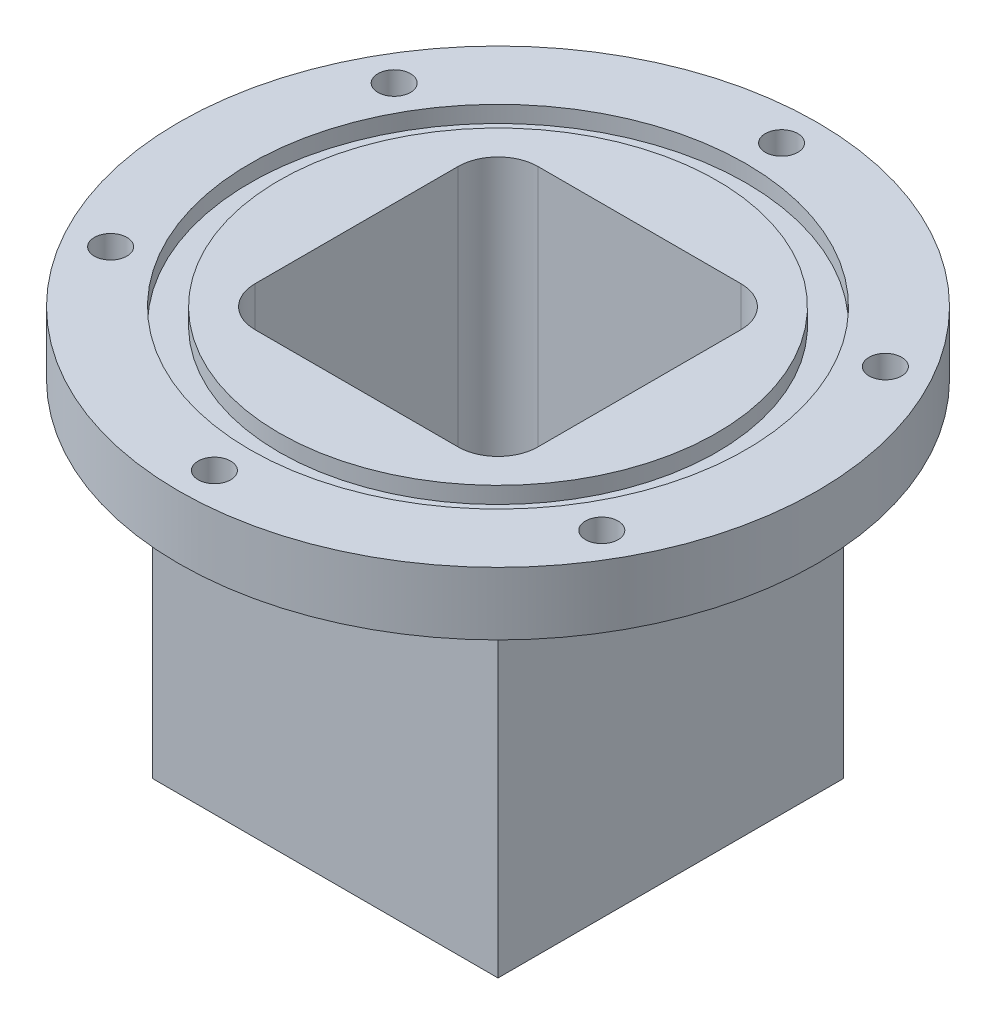
ISO-10303-21;
HEADER;
FILE_DESCRIPTION(('STEP AP214'),'2;1');
FILE_NAME('part.step','',(''),(''),'','','');
FILE_SCHEMA(('AUTOMOTIVE_DESIGN { 1 0 10303 214 1 1 1 1 }'));
ENDSEC;
DATA;
#1=APPLICATION_CONTEXT('core data for automotive mechanical design processes');
#2=APPLICATION_PROTOCOL_DEFINITION('international standard','automotive_design',2000,#1);
#3=PRODUCT_CONTEXT('',#1,'mechanical');
#4=PRODUCT('Part','Part','',(#3));
#5=PRODUCT_RELATED_PRODUCT_CATEGORY('part','',(#4));
#6=PRODUCT_DEFINITION_FORMATION('','',#4);
#7=PRODUCT_DEFINITION_CONTEXT('part definition',#1,'design');
#8=PRODUCT_DEFINITION('design','',#6,#7);
#9=PRODUCT_DEFINITION_SHAPE('','',#8);
#10=(LENGTH_UNIT() NAMED_UNIT(*) SI_UNIT(.MILLI.,.METRE.));
#11=(NAMED_UNIT(*) PLANE_ANGLE_UNIT() SI_UNIT($,.RADIAN.));
#12=(NAMED_UNIT(*) SI_UNIT($,.STERADIAN.) SOLID_ANGLE_UNIT());
#13=UNCERTAINTY_MEASURE_WITH_UNIT(LENGTH_MEASURE(1.E-05),#10,'distance_accuracy_value','');
#14=(GEOMETRIC_REPRESENTATION_CONTEXT(3) GLOBAL_UNCERTAINTY_ASSIGNED_CONTEXT((#13)) GLOBAL_UNIT_ASSIGNED_CONTEXT((#10,
#11,#12)) REPRESENTATION_CONTEXT('',''));
#15=CARTESIAN_POINT('',(0.,0.,0.));
#16=DIRECTION('',(0.,0.,1.));
#17=DIRECTION('',(1.,0.,0.));
#18=AXIS2_PLACEMENT_3D('',#15,#16,#17);
#19=CARTESIAN_POINT('',(0.,60.,0.));
#20=DIRECTION('',(0.,1.,0.));
#21=DIRECTION('',(0.,0.,1.));
#22=AXIS2_PLACEMENT_3D('',#19,#20,#21);
#23=PLANE('',#22);
#24=DIRECTION('',(0.,0.,-1.));
#25=VECTOR('',#24,1.);
#26=CARTESIAN_POINT('',(22.5,60.,0.));
#27=LINE('',#26,#25);
#28=CARTESIAN_POINT('',(22.5,60.,16.15));
#29=VERTEX_POINT('',#28);
#30=CARTESIAN_POINT('',(22.5,60.,-16.15));
#31=VERTEX_POINT('',#30);
#32=EDGE_CURVE('E277',#29,#31,#27,.T.);
#33=ORIENTED_EDGE('',*,*,#32,.F.);
#34=CARTESIAN_POINT('',(16.15,60.,16.15));
#35=DIRECTION('',(0.,1.,0.));
#36=DIRECTION('',(0.,0.,1.));
#37=AXIS2_PLACEMENT_3D('',#34,#35,#36);
#38=CIRCLE('',#37,6.35);
#39=CARTESIAN_POINT('',(16.15,60.,22.5));
#40=VERTEX_POINT('',#39);
#41=EDGE_CURVE('E199',#29,#40,#38,.F.);
#42=ORIENTED_EDGE('',*,*,#41,.T.);
#43=DIRECTION('',(-1.,0.,0.));
#44=VECTOR('',#43,1.);
#45=CARTESIAN_POINT('',(0.,60.,22.5));
#46=LINE('',#45,#44);
#47=CARTESIAN_POINT('',(-16.15,60.,22.5));
#48=VERTEX_POINT('',#47);
#49=EDGE_CURVE('E269',#40,#48,#46,.T.);
#50=ORIENTED_EDGE('',*,*,#49,.T.);
#51=CARTESIAN_POINT('',(-16.15,60.,16.15));
#52=DIRECTION('',(0.,1.,0.));
#53=DIRECTION('',(0.,0.,1.));
#54=AXIS2_PLACEMENT_3D('',#51,#52,#53);
#55=CIRCLE('',#54,6.35);
#56=CARTESIAN_POINT('',(-22.5,60.,16.15));
#57=VERTEX_POINT('',#56);
#58=EDGE_CURVE('E11',#48,#57,#55,.F.);
#59=ORIENTED_EDGE('',*,*,#58,.T.);
#60=DIRECTION('',(0.,0.,-1.));
#61=VECTOR('',#60,1.);
#62=CARTESIAN_POINT('',(-22.5,60.,0.));
#63=LINE('',#62,#61);
#64=CARTESIAN_POINT('',(-22.5,60.,-16.15));
#65=VERTEX_POINT('',#64);
#66=EDGE_CURVE('E271',#57,#65,#63,.T.);
#67=ORIENTED_EDGE('',*,*,#66,.T.);
#68=CARTESIAN_POINT('',(-16.15,60.,-16.15));
#69=DIRECTION('',(0.,1.,0.));
#70=DIRECTION('',(0.,0.,1.));
#71=AXIS2_PLACEMENT_3D('',#68,#69,#70);
#72=CIRCLE('',#71,6.35);
#73=CARTESIAN_POINT('',(-16.15,60.,-22.5));
#74=VERTEX_POINT('',#73);
#75=EDGE_CURVE('E46',#65,#74,#72,.F.);
#76=ORIENTED_EDGE('',*,*,#75,.T.);
#77=DIRECTION('',(-1.,0.,0.));
#78=VECTOR('',#77,1.);
#79=CARTESIAN_POINT('',(0.,60.,-22.5));
#80=LINE('',#79,#78);
#81=CARTESIAN_POINT('',(16.15,60.,-22.5));
#82=VERTEX_POINT('',#81);
#83=EDGE_CURVE('E274',#82,#74,#80,.T.);
#84=ORIENTED_EDGE('',*,*,#83,.F.);
#85=CARTESIAN_POINT('',(16.15,60.,-16.15));
#86=DIRECTION('',(0.,1.,0.));
#87=DIRECTION('',(0.,0.,1.));
#88=AXIS2_PLACEMENT_3D('',#85,#86,#87);
#89=CIRCLE('',#88,6.35);
#90=EDGE_CURVE('E197',#82,#31,#89,.F.);
#91=ORIENTED_EDGE('',*,*,#90,.T.);
#92=EDGE_LOOP('',(#33,#42,#50,#59,#67,#76,#84,#91));
#93=FACE_BOUND('',#92,.T.);
#94=CARTESIAN_POINT('',(0.,60.,0.));
#95=DIRECTION('',(0.,1.,0.));
#96=DIRECTION('',(0.,0.,1.));
#97=AXIS2_PLACEMENT_3D('',#94,#95,#96);
#98=CIRCLE('',#97,34.8198051533946);
#99=CARTESIAN_POINT('',(0.,60.,34.8198051533946));
#100=VERTEX_POINT('',#99);
#101=EDGE_CURVE('E205',#100,#100,#98,.T.);
#102=ORIENTED_EDGE('',*,*,#101,.T.);
#103=EDGE_LOOP('',(#102));
#104=FACE_BOUND('',#103,.T.);
#105=ADVANCED_FACE('F37',(#93,#104),#23,.T.);
#106=CARTESIAN_POINT('',(0.,60.,22.5));
#107=DIRECTION('',(0.,0.,1.));
#108=DIRECTION('',(1.,0.,0.));
#109=AXIS2_PLACEMENT_3D('',#106,#107,#108);
#110=PLANE('',#109);
#111=ORIENTED_EDGE('',*,*,#49,.F.);
#112=DIRECTION('',(0.,-1.,0.));
#113=VECTOR('',#112,1.);
#114=CARTESIAN_POINT('',(16.15,60.,22.5));
#115=LINE('',#114,#113);
#116=CARTESIAN_POINT('',(16.15,0.,22.5));
#117=VERTEX_POINT('',#116);
#118=EDGE_CURVE('E190',#40,#117,#115,.T.);
#119=ORIENTED_EDGE('',*,*,#118,.T.);
#120=DIRECTION('',(-1.,0.,0.));
#121=VECTOR('',#120,1.);
#122=CARTESIAN_POINT('',(0.,0.,22.5));
#123=LINE('',#122,#121);
#124=CARTESIAN_POINT('',(-16.15,0.,22.5));
#125=VERTEX_POINT('',#124);
#126=EDGE_CURVE('E266',#117,#125,#123,.T.);
#127=ORIENTED_EDGE('',*,*,#126,.T.);
#128=DIRECTION('',(0.,-1.,0.));
#129=VECTOR('',#128,1.);
#130=CARTESIAN_POINT('',(-16.15,60.,22.5));
#131=LINE('',#130,#129);
#132=EDGE_CURVE('E188',#125,#48,#131,.F.);
#133=ORIENTED_EDGE('',*,*,#132,.T.);
#134=EDGE_LOOP('',(#111,#119,#127,#133));
#135=FACE_BOUND('',#134,.T.);
#136=ADVANCED_FACE('F314',(#135),#110,.F.);
#137=CARTESIAN_POINT('',(-22.5,60.,0.));
#138=DIRECTION('',(-1.,0.,0.));
#139=DIRECTION('',(0.,0.,1.));
#140=AXIS2_PLACEMENT_3D('',#137,#138,#139);
#141=PLANE('',#140);
#142=DIRECTION('',(0.,0.,-1.));
#143=VECTOR('',#142,1.);
#144=CARTESIAN_POINT('',(-22.5,0.,0.));
#145=LINE('',#144,#143);
#146=CARTESIAN_POINT('',(-22.5,0.,16.15));
#147=VERTEX_POINT('',#146);
#148=CARTESIAN_POINT('',(-22.5,0.,-16.15));
#149=VERTEX_POINT('',#148);
#150=EDGE_CURVE('E283',#147,#149,#145,.T.);
#151=ORIENTED_EDGE('',*,*,#150,.T.);
#152=DIRECTION('',(0.,-1.,0.));
#153=VECTOR('',#152,1.);
#154=CARTESIAN_POINT('',(-22.5,60.,-16.15));
#155=LINE('',#154,#153);
#156=EDGE_CURVE('E54',#149,#65,#155,.F.);
#157=ORIENTED_EDGE('',*,*,#156,.T.);
#158=ORIENTED_EDGE('',*,*,#66,.F.);
#159=DIRECTION('',(0.,-1.,0.));
#160=VECTOR('',#159,1.);
#161=CARTESIAN_POINT('',(-22.5,0.,16.15));
#162=LINE('',#161,#160);
#163=EDGE_CURVE('E193',#57,#147,#162,.T.);
#164=ORIENTED_EDGE('',*,*,#163,.T.);
#165=EDGE_LOOP('',(#151,#157,#158,#164));
#166=FACE_BOUND('',#165,.T.);
#167=ADVANCED_FACE('F320',(#166),#141,.F.);
#168=CARTESIAN_POINT('',(0.,60.,-22.5));
#169=DIRECTION('',(0.,0.,1.));
#170=DIRECTION('',(1.,0.,0.));
#171=AXIS2_PLACEMENT_3D('',#168,#169,#170);
#172=PLANE('',#171);
#173=DIRECTION('',(-1.,0.,0.));
#174=VECTOR('',#173,1.);
#175=CARTESIAN_POINT('',(0.,0.,-22.5));
#176=LINE('',#175,#174);
#177=CARTESIAN_POINT('',(16.15,0.,-22.5));
#178=VERTEX_POINT('',#177);
#179=CARTESIAN_POINT('',(-16.15,0.,-22.5));
#180=VERTEX_POINT('',#179);
#181=EDGE_CURVE('E285',#178,#180,#176,.T.);
#182=ORIENTED_EDGE('',*,*,#181,.F.);
#183=DIRECTION('',(0.,-1.,0.));
#184=VECTOR('',#183,1.);
#185=CARTESIAN_POINT('',(16.15,60.,-22.5));
#186=LINE('',#185,#184);
#187=EDGE_CURVE('E186',#178,#82,#186,.F.);
#188=ORIENTED_EDGE('',*,*,#187,.T.);
#189=ORIENTED_EDGE('',*,*,#83,.T.);
#190=DIRECTION('',(0.,-1.,0.));
#191=VECTOR('',#190,1.);
#192=CARTESIAN_POINT('',(-16.15,60.,-22.5));
#193=LINE('',#192,#191);
#194=EDGE_CURVE('E183',#74,#180,#193,.T.);
#195=ORIENTED_EDGE('',*,*,#194,.T.);
#196=EDGE_LOOP('',(#182,#188,#189,#195));
#197=FACE_BOUND('',#196,.T.);
#198=ADVANCED_FACE('F338',(#197),#172,.T.);
#199=CARTESIAN_POINT('',(22.5,60.,0.));
#200=DIRECTION('',(-1.,0.,0.));
#201=DIRECTION('',(0.,0.,1.));
#202=AXIS2_PLACEMENT_3D('',#199,#200,#201);
#203=PLANE('',#202);
#204=ORIENTED_EDGE('',*,*,#32,.T.);
#205=DIRECTION('',(0.,-1.,0.));
#206=VECTOR('',#205,1.);
#207=CARTESIAN_POINT('',(22.5,0.,-16.15));
#208=LINE('',#207,#206);
#209=CARTESIAN_POINT('',(22.5,0.,-16.15));
#210=VERTEX_POINT('',#209);
#211=EDGE_CURVE('E172',#31,#210,#208,.T.);
#212=ORIENTED_EDGE('',*,*,#211,.T.);
#213=DIRECTION('',(0.,0.,-1.));
#214=VECTOR('',#213,1.);
#215=CARTESIAN_POINT('',(22.5,0.,0.));
#216=LINE('',#215,#214);
#217=CARTESIAN_POINT('',(22.5,0.,16.15));
#218=VERTEX_POINT('',#217);
#219=EDGE_CURVE('E272',#218,#210,#216,.T.);
#220=ORIENTED_EDGE('',*,*,#219,.F.);
#221=DIRECTION('',(0.,-1.,0.));
#222=VECTOR('',#221,1.);
#223=CARTESIAN_POINT('',(22.5,60.,16.15));
#224=LINE('',#223,#222);
#225=EDGE_CURVE('E156',#218,#29,#224,.F.);
#226=ORIENTED_EDGE('',*,*,#225,.T.);
#227=EDGE_LOOP('',(#204,#212,#220,#226));
#228=FACE_BOUND('',#227,.T.);
#229=ADVANCED_FACE('F329',(#228),#203,.T.);
#230=CARTESIAN_POINT('',(-39.0749818476991,60.,-22.5599512883481));
#231=DIRECTION('',(0.,1.,0.));
#232=DIRECTION('',(0.,0.,1.));
#233=AXIS2_PLACEMENT_3D('',#230,#231,#232);
#234=CIRCLE('',#233,2.59079999999998);
#235=CARTESIAN_POINT('',(-39.0749818476991,60.,-19.9691512883482));
#236=VERTEX_POINT('',#235);
#237=EDGE_CURVE('E230',#236,#236,#234,.T.);
#238=ORIENTED_EDGE('',*,*,#237,.F.);
#239=EDGE_LOOP('',(#238));
#240=FACE_BOUND('',#239,.T.);
#241=CARTESIAN_POINT('',(-4.8919202022546E-13,60.,-45.1199025766973));
#242=DIRECTION('',(0.,1.,0.));
#243=DIRECTION('',(0.,0.,1.));
#244=AXIS2_PLACEMENT_3D('',#241,#242,#243);
#245=CIRCLE('',#244,2.59079999999999);
#246=CARTESIAN_POINT('',(-4.8919202022546E-13,60.,-42.5291025766973));
#247=VERTEX_POINT('',#246);
#248=EDGE_CURVE('E220',#247,#247,#245,.T.);
#249=ORIENTED_EDGE('',*,*,#248,.F.);
#250=EDGE_LOOP('',(#249));
#251=FACE_BOUND('',#250,.T.);
#252=CARTESIAN_POINT('',(39.0749818476988,60.,-22.5599512883487));
#253=DIRECTION('',(0.,1.,0.));
#254=DIRECTION('',(0.,0.,1.));
#255=AXIS2_PLACEMENT_3D('',#252,#253,#254);
#256=CIRCLE('',#255,2.59079999999998);
#257=CARTESIAN_POINT('',(39.0749818476988,60.,-19.9691512883487));
#258=VERTEX_POINT('',#257);
#259=EDGE_CURVE('E217',#258,#258,#256,.T.);
#260=ORIENTED_EDGE('',*,*,#259,.F.);
#261=EDGE_LOOP('',(#260));
#262=FACE_BOUND('',#261,.T.);
#263=CARTESIAN_POINT('',(39.074981847699,60.,22.5599512883484));
#264=DIRECTION('',(0.,1.,0.));
#265=DIRECTION('',(0.,0.,1.));
#266=AXIS2_PLACEMENT_3D('',#263,#264,#265);
#267=CIRCLE('',#266,2.59079999999998);
#268=CARTESIAN_POINT('',(39.074981847699,60.,25.1507512883484));
#269=VERTEX_POINT('',#268);
#270=EDGE_CURVE('E214',#269,#269,#267,.T.);
#271=ORIENTED_EDGE('',*,*,#270,.F.);
#272=EDGE_LOOP('',(#271));
#273=FACE_BOUND('',#272,.T.);
#274=CARTESIAN_POINT('',(1.73472347597681E-13,60.,45.1199025766973));
#275=DIRECTION('',(0.,1.,0.));
#276=DIRECTION('',(0.,0.,1.));
#277=AXIS2_PLACEMENT_3D('',#274,#275,#276);
#278=CIRCLE('',#277,2.59079999999999);
#279=CARTESIAN_POINT('',(1.73472347597681E-13,60.,47.7107025766973));
#280=VERTEX_POINT('',#279);
#281=EDGE_CURVE('E210',#280,#280,#278,.T.);
#282=ORIENTED_EDGE('',*,*,#281,.F.);
#283=EDGE_LOOP('',(#282));
#284=FACE_BOUND('',#283,.T.);
#285=CARTESIAN_POINT('',(-39.0749818476988,60.,22.5599512883487));
#286=DIRECTION('',(0.,1.,0.));
#287=DIRECTION('',(0.,0.,1.));
#288=AXIS2_PLACEMENT_3D('',#285,#286,#287);
#289=CIRCLE('',#288,2.59079999999998);
#290=CARTESIAN_POINT('',(-39.0749818476988,60.,25.1507512883487));
#291=VERTEX_POINT('',#290);
#292=EDGE_CURVE('E206',#291,#291,#289,.T.);
#293=ORIENTED_EDGE('',*,*,#292,.F.);
#294=EDGE_LOOP('',(#293));
#295=FACE_BOUND('',#294,.T.);
#296=CARTESIAN_POINT('',(0.,60.,0.));
#297=DIRECTION('',(0.,1.,0.));
#298=DIRECTION('',(0.,0.,1.));
#299=AXIS2_PLACEMENT_3D('',#296,#297,#298);
#300=CIRCLE('',#299,39.4398051533946);
#301=CARTESIAN_POINT('',(0.,60.,39.4398051533946));
#302=VERTEX_POINT('',#301);
#303=EDGE_CURVE('E243',#302,#302,#300,.T.);
#304=ORIENTED_EDGE('',*,*,#303,.F.);
#305=EDGE_LOOP('',(#304));
#306=FACE_BOUND('',#305,.T.);
#307=CARTESIAN_POINT('',(0.,60.,0.));
#308=DIRECTION('',(0.,1.,0.));
#309=DIRECTION('',(0.,0.,1.));
#310=AXIS2_PLACEMENT_3D('',#307,#308,#309);
#311=CIRCLE('',#310,50.8);
#312=CARTESIAN_POINT('',(0.,60.,50.8));
#313=VERTEX_POINT('',#312);
#314=EDGE_CURVE('E147',#313,#313,#311,.T.);
#315=ORIENTED_EDGE('',*,*,#314,.T.);
#316=EDGE_LOOP('',(#315));
#317=FACE_BOUND('',#316,.T.);
#318=ADVANCED_FACE('F316',(#240,#251,#262,#273,#284,#295,#306,#317),#23,.T.);
#319=CARTESIAN_POINT('',(0.,0.,0.));
#320=DIRECTION('',(0.,1.,0.));
#321=DIRECTION('',(0.,0.,1.));
#322=AXIS2_PLACEMENT_3D('',#319,#320,#321);
#323=PLANE('',#322);
#324=CARTESIAN_POINT('',(0.,0.,0.));
#325=DIRECTION('',(0.,1.,0.));
#326=DIRECTION('',(0.,0.,1.));
#327=AXIS2_PLACEMENT_3D('',#324,#325,#326);
#328=CIRCLE('',#327,2.5908);
#329=CARTESIAN_POINT('',(0.,0.,2.5908));
#330=VERTEX_POINT('',#329);
#331=EDGE_CURVE('E169',#330,#330,#328,.F.);
#332=ORIENTED_EDGE('',*,*,#331,.T.);
#333=EDGE_LOOP('',(#332));
#334=FACE_BOUND('',#333,.T.);
#335=ORIENTED_EDGE('',*,*,#219,.T.);
#336=CARTESIAN_POINT('',(16.15,0.,-16.15));
#337=DIRECTION('',(0.,1.,0.));
#338=DIRECTION('',(0.,0.,1.));
#339=AXIS2_PLACEMENT_3D('',#336,#337,#338);
#340=CIRCLE('',#339,6.35);
#341=EDGE_CURVE('E181',#210,#178,#340,.T.);
#342=ORIENTED_EDGE('',*,*,#341,.T.);
#343=ORIENTED_EDGE('',*,*,#181,.T.);
#344=CARTESIAN_POINT('',(-16.15,0.,-16.15));
#345=DIRECTION('',(0.,1.,0.));
#346=DIRECTION('',(0.,0.,1.));
#347=AXIS2_PLACEMENT_3D('',#344,#345,#346);
#348=CIRCLE('',#347,6.35);
#349=EDGE_CURVE('E177',#180,#149,#348,.T.);
#350=ORIENTED_EDGE('',*,*,#349,.T.);
#351=ORIENTED_EDGE('',*,*,#150,.F.);
#352=CARTESIAN_POINT('',(-16.15,0.,16.15));
#353=DIRECTION('',(0.,1.,0.));
#354=DIRECTION('',(0.,0.,1.));
#355=AXIS2_PLACEMENT_3D('',#352,#353,#354);
#356=CIRCLE('',#355,6.35);
#357=EDGE_CURVE('E175',#147,#125,#356,.T.);
#358=ORIENTED_EDGE('',*,*,#357,.T.);
#359=ORIENTED_EDGE('',*,*,#126,.F.);
#360=CARTESIAN_POINT('',(16.15,0.,16.15));
#361=DIRECTION('',(0.,1.,0.));
#362=DIRECTION('',(0.,0.,1.));
#363=AXIS2_PLACEMENT_3D('',#360,#361,#362);
#364=CIRCLE('',#363,6.35);
#365=EDGE_CURVE('E179',#117,#218,#364,.T.);
#366=ORIENTED_EDGE('',*,*,#365,.T.);
#367=EDGE_LOOP('',(#335,#342,#343,#350,#351,#358,#359,#366));
#368=FACE_BOUND('',#367,.T.);
#369=ADVANCED_FACE('F328',(#334,#368),#323,.T.);
#370=CARTESIAN_POINT('',(0.,50.,0.));
#371=DIRECTION('',(0.,1.,0.));
#372=DIRECTION('',(0.,0.,1.));
#373=AXIS2_PLACEMENT_3D('',#370,#371,#372);
#374=CYLINDRICAL_SURFACE('',#373,50.8);
#375=CARTESIAN_POINT('',(0.,50.,0.));
#376=DIRECTION('',(0.,1.,0.));
#377=DIRECTION('',(0.,0.,1.));
#378=AXIS2_PLACEMENT_3D('',#375,#376,#377);
#379=CIRCLE('',#378,50.8);
#380=CARTESIAN_POINT('',(0.,50.,50.8));
#381=VERTEX_POINT('',#380);
#382=EDGE_CURVE('E263',#381,#381,#379,.T.);
#383=ORIENTED_EDGE('',*,*,#382,.T.);
#384=EDGE_LOOP('',(#383));
#385=FACE_BOUND('',#384,.T.);
#386=ORIENTED_EDGE('',*,*,#314,.F.);
#387=EDGE_LOOP('',(#386));
#388=FACE_BOUND('',#387,.T.);
#389=ADVANCED_FACE('F335',(#385,#388),#374,.T.);
#390=CARTESIAN_POINT('',(0.,50.,0.));
#391=DIRECTION('',(0.,1.,0.));
#392=DIRECTION('',(0.,0.,1.));
#393=AXIS2_PLACEMENT_3D('',#390,#391,#392);
#394=PLANE('',#393);
#395=CARTESIAN_POINT('',(-39.0749818476991,50.,-22.5599512883481));
#396=DIRECTION('',(0.,1.,0.));
#397=DIRECTION('',(0.,0.,1.));
#398=AXIS2_PLACEMENT_3D('',#395,#396,#397);
#399=CIRCLE('',#398,2.59079999999998);
#400=CARTESIAN_POINT('',(-39.0749818476991,50.,-19.9691512883482));
#401=VERTEX_POINT('',#400);
#402=EDGE_CURVE('E41',#401,#401,#399,.T.);
#403=ORIENTED_EDGE('',*,*,#402,.T.);
#404=EDGE_LOOP('',(#403));
#405=FACE_BOUND('',#404,.T.);
#406=CARTESIAN_POINT('',(-4.8919202022546E-13,50.,-45.1199025766973));
#407=DIRECTION('',(0.,1.,0.));
#408=DIRECTION('',(0.,0.,1.));
#409=AXIS2_PLACEMENT_3D('',#406,#407,#408);
#410=CIRCLE('',#409,2.59079999999998);
#411=CARTESIAN_POINT('',(-4.8919202022546E-13,50.,-42.5291025766973));
#412=VERTEX_POINT('',#411);
#413=EDGE_CURVE('E218',#412,#412,#410,.T.);
#414=ORIENTED_EDGE('',*,*,#413,.T.);
#415=EDGE_LOOP('',(#414));
#416=FACE_BOUND('',#415,.T.);
#417=CARTESIAN_POINT('',(39.0749818476988,50.,-22.5599512883487));
#418=DIRECTION('',(0.,1.,0.));
#419=DIRECTION('',(0.,0.,1.));
#420=AXIS2_PLACEMENT_3D('',#417,#418,#419);
#421=CIRCLE('',#420,2.59079999999998);
#422=CARTESIAN_POINT('',(39.0749818476988,50.,-19.9691512883487));
#423=VERTEX_POINT('',#422);
#424=EDGE_CURVE('E215',#423,#423,#421,.T.);
#425=ORIENTED_EDGE('',*,*,#424,.T.);
#426=EDGE_LOOP('',(#425));
#427=FACE_BOUND('',#426,.T.);
#428=CARTESIAN_POINT('',(39.074981847699,50.,22.5599512883484));
#429=DIRECTION('',(0.,1.,0.));
#430=DIRECTION('',(0.,0.,1.));
#431=AXIS2_PLACEMENT_3D('',#428,#429,#430);
#432=CIRCLE('',#431,2.59079999999998);
#433=CARTESIAN_POINT('',(39.074981847699,50.,25.1507512883484));
#434=VERTEX_POINT('',#433);
#435=EDGE_CURVE('E211',#434,#434,#432,.T.);
#436=ORIENTED_EDGE('',*,*,#435,.T.);
#437=EDGE_LOOP('',(#436));
#438=FACE_BOUND('',#437,.T.);
#439=CARTESIAN_POINT('',(1.73472347597681E-13,50.,45.1199025766973));
#440=DIRECTION('',(0.,1.,0.));
#441=DIRECTION('',(0.,0.,1.));
#442=AXIS2_PLACEMENT_3D('',#439,#440,#441);
#443=CIRCLE('',#442,2.59079999999998);
#444=CARTESIAN_POINT('',(1.73472347597681E-13,50.,47.7107025766973));
#445=VERTEX_POINT('',#444);
#446=EDGE_CURVE('E207',#445,#445,#443,.T.);
#447=ORIENTED_EDGE('',*,*,#446,.T.);
#448=EDGE_LOOP('',(#447));
#449=FACE_BOUND('',#448,.T.);
#450=CARTESIAN_POINT('',(-39.0749818476988,50.,22.5599512883487));
#451=DIRECTION('',(0.,1.,0.));
#452=DIRECTION('',(0.,0.,1.));
#453=AXIS2_PLACEMENT_3D('',#450,#451,#452);
#454=CIRCLE('',#453,2.59079999999998);
#455=CARTESIAN_POINT('',(-39.0749818476988,50.,25.1507512883487));
#456=VERTEX_POINT('',#455);
#457=EDGE_CURVE('E202',#456,#456,#454,.T.);
#458=ORIENTED_EDGE('',*,*,#457,.T.);
#459=EDGE_LOOP('',(#458));
#460=FACE_BOUND('',#459,.T.);
#461=DIRECTION('',(1.,0.,0.));
#462=VECTOR('',#461,1.);
#463=CARTESIAN_POINT('',(0.,50.,27.5));
#464=LINE('',#463,#462);
#465=CARTESIAN_POINT('',(-27.5,50.,27.5));
#466=VERTEX_POINT('',#465);
#467=CARTESIAN_POINT('',(27.5,50.,27.5));
#468=VERTEX_POINT('',#467);
#469=EDGE_CURVE('E131',#466,#468,#464,.T.);
#470=ORIENTED_EDGE('',*,*,#469,.T.);
#471=DIRECTION('',(0.,0.,-1.));
#472=VECTOR('',#471,1.);
#473=CARTESIAN_POINT('',(27.5,50.,0.));
#474=LINE('',#473,#472);
#475=CARTESIAN_POINT('',(27.5,50.,-27.5));
#476=VERTEX_POINT('',#475);
#477=EDGE_CURVE('E261',#468,#476,#474,.T.);
#478=ORIENTED_EDGE('',*,*,#477,.T.);
#479=DIRECTION('',(-1.,0.,0.));
#480=VECTOR('',#479,1.);
#481=CARTESIAN_POINT('',(0.,50.,-27.5));
#482=LINE('',#481,#480);
#483=CARTESIAN_POINT('',(-27.5,50.,-27.5));
#484=VERTEX_POINT('',#483);
#485=EDGE_CURVE('E134',#476,#484,#482,.T.);
#486=ORIENTED_EDGE('',*,*,#485,.T.);
#487=DIRECTION('',(0.,0.,1.));
#488=VECTOR('',#487,1.);
#489=CARTESIAN_POINT('',(-27.5,50.,0.));
#490=LINE('',#489,#488);
#491=EDGE_CURVE('E127',#484,#466,#490,.T.);
#492=ORIENTED_EDGE('',*,*,#491,.T.);
#493=EDGE_LOOP('',(#470,#478,#486,#492));
#494=FACE_BOUND('',#493,.T.);
#495=ORIENTED_EDGE('',*,*,#382,.F.);
#496=EDGE_LOOP('',(#495));
#497=FACE_BOUND('',#496,.T.);
#498=ADVANCED_FACE('F129',(#405,#416,#427,#438,#449,#460,#494,#497),#394,.F.);
#499=CARTESIAN_POINT('',(0.,-5.,0.));
#500=DIRECTION('',(0.,1.,0.));
#501=DIRECTION('',(0.,0.,1.));
#502=AXIS2_PLACEMENT_3D('',#499,#500,#501);
#503=PLANE('',#502);
#504=CARTESIAN_POINT('',(0.,-5.,0.));
#505=DIRECTION('',(0.,1.,0.));
#506=DIRECTION('',(0.,0.,1.));
#507=AXIS2_PLACEMENT_3D('',#504,#505,#506);
#508=CIRCLE('',#507,12.);
#509=CARTESIAN_POINT('',(0.,-5.,12.));
#510=VERTEX_POINT('',#509);
#511=EDGE_CURVE('E152',#510,#510,#508,.F.);
#512=ORIENTED_EDGE('',*,*,#511,.F.);
#513=EDGE_LOOP('',(#512));
#514=FACE_BOUND('',#513,.T.);
#515=DIRECTION('',(-1.,0.,0.));
#516=VECTOR('',#515,1.);
#517=CARTESIAN_POINT('',(0.,-5.,27.5));
#518=LINE('',#517,#516);
#519=CARTESIAN_POINT('',(27.5,-5.,27.5));
#520=VERTEX_POINT('',#519);
#521=CARTESIAN_POINT('',(-27.5,-5.,27.5));
#522=VERTEX_POINT('',#521);
#523=EDGE_CURVE('E280',#520,#522,#518,.T.);
#524=ORIENTED_EDGE('',*,*,#523,.T.);
#525=DIRECTION('',(0.,0.,-1.));
#526=VECTOR('',#525,1.);
#527=CARTESIAN_POINT('',(-27.5,-5.,0.));
#528=LINE('',#527,#526);
#529=CARTESIAN_POINT('',(-27.5,-5.,-27.5));
#530=VERTEX_POINT('',#529);
#531=EDGE_CURVE('E150',#522,#530,#528,.T.);
#532=ORIENTED_EDGE('',*,*,#531,.T.);
#533=DIRECTION('',(-1.,0.,0.));
#534=VECTOR('',#533,1.);
#535=CARTESIAN_POINT('',(0.,-5.,-27.5));
#536=LINE('',#535,#534);
#537=CARTESIAN_POINT('',(27.5,-5.,-27.5));
#538=VERTEX_POINT('',#537);
#539=EDGE_CURVE('E293',#538,#530,#536,.T.);
#540=ORIENTED_EDGE('',*,*,#539,.F.);
#541=DIRECTION('',(0.,0.,-1.));
#542=VECTOR('',#541,1.);
#543=CARTESIAN_POINT('',(27.5,-5.,0.));
#544=LINE('',#543,#542);
#545=EDGE_CURVE('E291',#520,#538,#544,.T.);
#546=ORIENTED_EDGE('',*,*,#545,.F.);
#547=EDGE_LOOP('',(#524,#532,#540,#546));
#548=FACE_BOUND('',#547,.T.);
#549=ADVANCED_FACE('F298',(#514,#548),#503,.F.);
#550=CARTESIAN_POINT('',(27.5,-5.,0.));
#551=DIRECTION('',(1.,0.,0.));
#552=DIRECTION('',(0.,0.,-1.));
#553=AXIS2_PLACEMENT_3D('',#550,#551,#552);
#554=PLANE('',#553);
#555=DIRECTION('',(0.,1.,0.));
#556=VECTOR('',#555,1.);
#557=CARTESIAN_POINT('',(27.5,-5.,-27.5));
#558=LINE('',#557,#556);
#559=EDGE_CURVE('E158',#538,#476,#558,.T.);
#560=ORIENTED_EDGE('',*,*,#559,.T.);
#561=ORIENTED_EDGE('',*,*,#477,.F.);
#562=DIRECTION('',(0.,1.,0.));
#563=VECTOR('',#562,1.);
#564=CARTESIAN_POINT('',(27.5,-5.,27.5));
#565=LINE('',#564,#563);
#566=EDGE_CURVE('E146',#520,#468,#565,.T.);
#567=ORIENTED_EDGE('',*,*,#566,.F.);
#568=ORIENTED_EDGE('',*,*,#545,.T.);
#569=EDGE_LOOP('',(#560,#561,#567,#568));
#570=FACE_BOUND('',#569,.T.);
#571=ADVANCED_FACE('F302',(#570),#554,.T.);
#572=CARTESIAN_POINT('',(0.,-5.,-27.5));
#573=DIRECTION('',(0.,0.,-1.));
#574=DIRECTION('',(-1.,0.,0.));
#575=AXIS2_PLACEMENT_3D('',#572,#573,#574);
#576=PLANE('',#575);
#577=DIRECTION('',(0.,1.,0.));
#578=VECTOR('',#577,1.);
#579=CARTESIAN_POINT('',(-27.5,-5.,-27.5));
#580=LINE('',#579,#578);
#581=EDGE_CURVE('E153',#530,#484,#580,.T.);
#582=ORIENTED_EDGE('',*,*,#581,.T.);
#583=ORIENTED_EDGE('',*,*,#485,.F.);
#584=ORIENTED_EDGE('',*,*,#559,.F.);
#585=ORIENTED_EDGE('',*,*,#539,.T.);
#586=EDGE_LOOP('',(#582,#583,#584,#585));
#587=FACE_BOUND('',#586,.T.);
#588=ADVANCED_FACE('F300',(#587),#576,.T.);
#589=CARTESIAN_POINT('',(-27.5,-5.,0.));
#590=DIRECTION('',(1.,0.,0.));
#591=DIRECTION('',(0.,0.,-1.));
#592=AXIS2_PLACEMENT_3D('',#589,#590,#591);
#593=PLANE('',#592);
#594=ORIENTED_EDGE('',*,*,#491,.F.);
#595=ORIENTED_EDGE('',*,*,#581,.F.);
#596=ORIENTED_EDGE('',*,*,#531,.F.);
#597=DIRECTION('',(0.,1.,0.));
#598=VECTOR('',#597,1.);
#599=CARTESIAN_POINT('',(-27.5,-5.,27.5));
#600=LINE('',#599,#598);
#601=EDGE_CURVE('E145',#522,#466,#600,.T.);
#602=ORIENTED_EDGE('',*,*,#601,.T.);
#603=EDGE_LOOP('',(#594,#595,#596,#602));
#604=FACE_BOUND('',#603,.T.);
#605=ADVANCED_FACE('F149',(#604),#593,.F.);
#606=CARTESIAN_POINT('',(0.,-5.,27.5));
#607=DIRECTION('',(0.,0.,-1.));
#608=DIRECTION('',(-1.,0.,0.));
#609=AXIS2_PLACEMENT_3D('',#606,#607,#608);
#610=PLANE('',#609);
#611=ORIENTED_EDGE('',*,*,#469,.F.);
#612=ORIENTED_EDGE('',*,*,#601,.F.);
#613=ORIENTED_EDGE('',*,*,#523,.F.);
#614=ORIENTED_EDGE('',*,*,#566,.T.);
#615=EDGE_LOOP('',(#611,#612,#613,#614));
#616=FACE_BOUND('',#615,.T.);
#617=ADVANCED_FACE('F143',(#616),#610,.F.);
#618=CARTESIAN_POINT('',(0.,-15.,0.));
#619=DIRECTION('',(0.,1.,0.));
#620=DIRECTION('',(0.,0.,1.));
#621=AXIS2_PLACEMENT_3D('',#618,#619,#620);
#622=CYLINDRICAL_SURFACE('',#621,12.);
#623=CARTESIAN_POINT('',(0.,-15.,0.));
#624=DIRECTION('',(0.,-1.,0.));
#625=DIRECTION('',(0.,0.,-1.));
#626=AXIS2_PLACEMENT_3D('',#623,#624,#625);
#627=CIRCLE('',#626,12.);
#628=CARTESIAN_POINT('',(0.,-15.,-12.));
#629=VERTEX_POINT('',#628);
#630=EDGE_CURVE('E257',#629,#629,#627,.T.);
#631=ORIENTED_EDGE('',*,*,#630,.F.);
#632=EDGE_LOOP('',(#631));
#633=FACE_BOUND('',#632,.T.);
#634=ORIENTED_EDGE('',*,*,#511,.T.);
#635=EDGE_LOOP('',(#634));
#636=FACE_BOUND('',#635,.T.);
#637=ADVANCED_FACE('F364',(#633,#636),#622,.T.);
#638=CARTESIAN_POINT('',(0.,-15.,0.));
#639=DIRECTION('',(0.,-1.,0.));
#640=DIRECTION('',(0.,0.,-1.));
#641=AXIS2_PLACEMENT_3D('',#638,#639,#640);
#642=PLANE('',#641);
#643=CARTESIAN_POINT('',(0.,-15.,0.));
#644=DIRECTION('',(0.,-1.,0.));
#645=DIRECTION('',(0.,0.,-1.));
#646=AXIS2_PLACEMENT_3D('',#643,#644,#645);
#647=CIRCLE('',#646,7.);
#648=CARTESIAN_POINT('',(0.,-15.,-7.));
#649=VERTEX_POINT('',#648);
#650=EDGE_CURVE('E246',#649,#649,#647,.T.);
#651=ORIENTED_EDGE('',*,*,#650,.F.);
#652=EDGE_LOOP('',(#651));
#653=FACE_BOUND('',#652,.T.);
#654=ORIENTED_EDGE('',*,*,#630,.T.);
#655=EDGE_LOOP('',(#654));
#656=FACE_BOUND('',#655,.T.);
#657=ADVANCED_FACE('F367',(#653,#656),#642,.T.);
#658=CARTESIAN_POINT('',(0.,-15.,0.));
#659=DIRECTION('',(0.,-1.,0.));
#660=DIRECTION('',(0.,0.,-1.));
#661=AXIS2_PLACEMENT_3D('',#658,#659,#660);
#662=CYLINDRICAL_SURFACE('',#661,2.5908);
#663=CARTESIAN_POINT('',(0.,-5.,0.));
#664=DIRECTION('',(0.,1.,0.));
#665=DIRECTION('',(0.,0.,1.));
#666=AXIS2_PLACEMENT_3D('',#663,#664,#665);
#667=CIRCLE('',#666,2.5908);
#668=CARTESIAN_POINT('',(0.,-5.,2.5908));
#669=VERTEX_POINT('',#668);
#670=EDGE_CURVE('E166',#669,#669,#667,.F.);
#671=ORIENTED_EDGE('',*,*,#670,.T.);
#672=EDGE_LOOP('',(#671));
#673=FACE_BOUND('',#672,.T.);
#674=ORIENTED_EDGE('',*,*,#331,.F.);
#675=EDGE_LOOP('',(#674));
#676=FACE_BOUND('',#675,.T.);
#677=ADVANCED_FACE('F371',(#673,#676),#662,.F.);
#678=CARTESIAN_POINT('',(0.,-5.,0.));
#679=DIRECTION('',(0.,1.,0.));
#680=DIRECTION('',(0.,0.,1.));
#681=AXIS2_PLACEMENT_3D('',#678,#679,#680);
#682=PLANE('',#681);
#683=CARTESIAN_POINT('',(0.,-5.,0.));
#684=DIRECTION('',(0.,1.,0.));
#685=DIRECTION('',(0.,0.,1.));
#686=AXIS2_PLACEMENT_3D('',#683,#684,#685);
#687=CIRCLE('',#686,7.);
#688=CARTESIAN_POINT('',(0.,-5.,7.));
#689=VERTEX_POINT('',#688);
#690=EDGE_CURVE('E170',#689,#689,#687,.F.);
#691=ORIENTED_EDGE('',*,*,#690,.T.);
#692=EDGE_LOOP('',(#691));
#693=FACE_BOUND('',#692,.T.);
#694=ORIENTED_EDGE('',*,*,#670,.F.);
#695=EDGE_LOOP('',(#694));
#696=FACE_BOUND('',#695,.T.);
#697=ADVANCED_FACE('F375',(#693,#696),#682,.F.);
#698=CARTESIAN_POINT('',(0.,14.7989898732233,0.));
#699=DIRECTION('',(0.,-1.,0.));
#700=DIRECTION('',(0.,0.,-1.));
#701=AXIS2_PLACEMENT_3D('',#698,#699,#700);
#702=CYLINDRICAL_SURFACE('',#701,7.);
#703=ORIENTED_EDGE('',*,*,#650,.T.);
#704=EDGE_LOOP('',(#703));
#705=FACE_BOUND('',#704,.T.);
#706=ORIENTED_EDGE('',*,*,#690,.F.);
#707=EDGE_LOOP('',(#706));
#708=FACE_BOUND('',#707,.T.);
#709=ADVANCED_FACE('F379',(#705,#708),#702,.F.);
#710=CARTESIAN_POINT('',(0.,57.36,0.));
#711=DIRECTION('',(0.,1.,0.));
#712=DIRECTION('',(0.,0.,1.));
#713=AXIS2_PLACEMENT_3D('',#710,#711,#712);
#714=CYLINDRICAL_SURFACE('',#713,34.8198051533946);
#715=CARTESIAN_POINT('',(0.,57.36,0.));
#716=DIRECTION('',(0.,1.,0.));
#717=DIRECTION('',(0.,0.,1.));
#718=AXIS2_PLACEMENT_3D('',#715,#716,#717);
#719=CIRCLE('',#718,34.8198051533946);
#720=CARTESIAN_POINT('',(0.,57.36,34.8198051533946));
#721=VERTEX_POINT('',#720);
#722=EDGE_CURVE('E239',#721,#721,#719,.T.);
#723=ORIENTED_EDGE('',*,*,#722,.T.);
#724=EDGE_LOOP('',(#723));
#725=FACE_BOUND('',#724,.T.);
#726=ORIENTED_EDGE('',*,*,#101,.F.);
#727=EDGE_LOOP('',(#726));
#728=FACE_BOUND('',#727,.T.);
#729=ADVANCED_FACE('F383',(#725,#728),#714,.T.);
#730=CARTESIAN_POINT('',(0.,57.36,0.));
#731=DIRECTION('',(0.,1.,0.));
#732=DIRECTION('',(0.,0.,1.));
#733=AXIS2_PLACEMENT_3D('',#730,#731,#732);
#734=CYLINDRICAL_SURFACE('',#733,39.4398051533946);
#735=CARTESIAN_POINT('',(0.,57.36,0.));
#736=DIRECTION('',(0.,1.,0.));
#737=DIRECTION('',(0.,0.,1.));
#738=AXIS2_PLACEMENT_3D('',#735,#736,#737);
#739=CIRCLE('',#738,39.4398051533946);
#740=CARTESIAN_POINT('',(0.,57.36,39.4398051533946));
#741=VERTEX_POINT('',#740);
#742=EDGE_CURVE('E242',#741,#741,#739,.T.);
#743=ORIENTED_EDGE('',*,*,#742,.F.);
#744=EDGE_LOOP('',(#743));
#745=FACE_BOUND('',#744,.T.);
#746=ORIENTED_EDGE('',*,*,#303,.T.);
#747=EDGE_LOOP('',(#746));
#748=FACE_BOUND('',#747,.T.);
#749=ADVANCED_FACE('F387',(#745,#748),#734,.F.);
#750=CARTESIAN_POINT('',(0.,57.36,0.));
#751=DIRECTION('',(0.,1.,0.));
#752=DIRECTION('',(0.,0.,1.));
#753=AXIS2_PLACEMENT_3D('',#750,#751,#752);
#754=PLANE('',#753);
#755=ORIENTED_EDGE('',*,*,#722,.F.);
#756=EDGE_LOOP('',(#755));
#757=FACE_BOUND('',#756,.T.);
#758=ORIENTED_EDGE('',*,*,#742,.T.);
#759=EDGE_LOOP('',(#758));
#760=FACE_BOUND('',#759,.T.);
#761=ADVANCED_FACE('F391',(#757,#760),#754,.T.);
#762=CARTESIAN_POINT('',(16.15,60.,-16.15));
#763=DIRECTION('',(0.,1.,0.));
#764=DIRECTION('',(0.,0.,1.));
#765=AXIS2_PLACEMENT_3D('',#762,#763,#764);
#766=CYLINDRICAL_SURFACE('',#765,6.35);
#767=ORIENTED_EDGE('',*,*,#90,.F.);
#768=ORIENTED_EDGE('',*,*,#187,.F.);
#769=ORIENTED_EDGE('',*,*,#341,.F.);
#770=ORIENTED_EDGE('',*,*,#211,.F.);
#771=EDGE_LOOP('',(#767,#768,#769,#770));
#772=FACE_BOUND('',#771,.T.);
#773=ADVANCED_FACE('F395',(#772),#766,.F.);
#774=CARTESIAN_POINT('',(16.15,60.,16.15));
#775=DIRECTION('',(0.,-1.,0.));
#776=DIRECTION('',(0.,0.,-1.));
#777=AXIS2_PLACEMENT_3D('',#774,#775,#776);
#778=CYLINDRICAL_SURFACE('',#777,6.35);
#779=ORIENTED_EDGE('',*,*,#41,.F.);
#780=ORIENTED_EDGE('',*,*,#225,.F.);
#781=ORIENTED_EDGE('',*,*,#365,.F.);
#782=ORIENTED_EDGE('',*,*,#118,.F.);
#783=EDGE_LOOP('',(#779,#780,#781,#782));
#784=FACE_BOUND('',#783,.T.);
#785=ADVANCED_FACE('F469',(#784),#778,.F.);
#786=CARTESIAN_POINT('',(-16.15,60.,-16.15));
#787=DIRECTION('',(0.,-1.,0.));
#788=DIRECTION('',(0.,0.,-1.));
#789=AXIS2_PLACEMENT_3D('',#786,#787,#788);
#790=CYLINDRICAL_SURFACE('',#789,6.35);
#791=ORIENTED_EDGE('',*,*,#75,.F.);
#792=ORIENTED_EDGE('',*,*,#156,.F.);
#793=ORIENTED_EDGE('',*,*,#349,.F.);
#794=ORIENTED_EDGE('',*,*,#194,.F.);
#795=EDGE_LOOP('',(#791,#792,#793,#794));
#796=FACE_BOUND('',#795,.T.);
#797=ADVANCED_FACE('F462',(#796),#790,.F.);
#798=CARTESIAN_POINT('',(-16.15,60.,16.15));
#799=DIRECTION('',(0.,1.,0.));
#800=DIRECTION('',(0.,0.,1.));
#801=AXIS2_PLACEMENT_3D('',#798,#799,#800);
#802=CYLINDRICAL_SURFACE('',#801,6.35);
#803=ORIENTED_EDGE('',*,*,#58,.F.);
#804=ORIENTED_EDGE('',*,*,#132,.F.);
#805=ORIENTED_EDGE('',*,*,#357,.F.);
#806=ORIENTED_EDGE('',*,*,#163,.F.);
#807=EDGE_LOOP('',(#803,#804,#805,#806));
#808=FACE_BOUND('',#807,.T.);
#809=ADVANCED_FACE('F39',(#808),#802,.F.);
#810=CARTESIAN_POINT('',(-39.0749818476988,60.,22.5599512883487));
#811=DIRECTION('',(0.,1.,0.));
#812=DIRECTION('',(0.,0.,1.));
#813=AXIS2_PLACEMENT_3D('',#810,#811,#812);
#814=CYLINDRICAL_SURFACE('',#813,2.59079999999998);
#815=ORIENTED_EDGE('',*,*,#292,.T.);
#816=EDGE_LOOP('',(#815));
#817=FACE_BOUND('',#816,.T.);
#818=ORIENTED_EDGE('',*,*,#457,.F.);
#819=EDGE_LOOP('',(#818));
#820=FACE_BOUND('',#819,.T.);
#821=ADVANCED_FACE('F397',(#817,#820),#814,.F.);
#822=CARTESIAN_POINT('',(1.73472347597681E-13,60.,45.1199025766973));
#823=DIRECTION('',(0.,1.,0.));
#824=DIRECTION('',(0.,0.,1.));
#825=AXIS2_PLACEMENT_3D('',#822,#823,#824);
#826=CYLINDRICAL_SURFACE('',#825,2.59079999999998);
#827=ORIENTED_EDGE('',*,*,#281,.T.);
#828=EDGE_LOOP('',(#827));
#829=FACE_BOUND('',#828,.T.);
#830=ORIENTED_EDGE('',*,*,#446,.F.);
#831=EDGE_LOOP('',(#830));
#832=FACE_BOUND('',#831,.T.);
#833=ADVANCED_FACE('F400',(#829,#832),#826,.F.);
#834=CARTESIAN_POINT('',(39.074981847699,60.,22.5599512883484));
#835=DIRECTION('',(0.,1.,0.));
#836=DIRECTION('',(0.,0.,1.));
#837=AXIS2_PLACEMENT_3D('',#834,#835,#836);
#838=CYLINDRICAL_SURFACE('',#837,2.59079999999998);
#839=ORIENTED_EDGE('',*,*,#270,.T.);
#840=EDGE_LOOP('',(#839));
#841=FACE_BOUND('',#840,.T.);
#842=ORIENTED_EDGE('',*,*,#435,.F.);
#843=EDGE_LOOP('',(#842));
#844=FACE_BOUND('',#843,.T.);
#845=ADVANCED_FACE('F404',(#841,#844),#838,.F.);
#846=CARTESIAN_POINT('',(39.0749818476988,60.,-22.5599512883487));
#847=DIRECTION('',(0.,1.,0.));
#848=DIRECTION('',(0.,0.,1.));
#849=AXIS2_PLACEMENT_3D('',#846,#847,#848);
#850=CYLINDRICAL_SURFACE('',#849,2.59079999999998);
#851=ORIENTED_EDGE('',*,*,#259,.T.);
#852=EDGE_LOOP('',(#851));
#853=FACE_BOUND('',#852,.T.);
#854=ORIENTED_EDGE('',*,*,#424,.F.);
#855=EDGE_LOOP('',(#854));
#856=FACE_BOUND('',#855,.T.);
#857=ADVANCED_FACE('F408',(#853,#856),#850,.F.);
#858=CARTESIAN_POINT('',(-4.8919202022546E-13,60.,-45.1199025766973));
#859=DIRECTION('',(0.,1.,0.));
#860=DIRECTION('',(0.,0.,1.));
#861=AXIS2_PLACEMENT_3D('',#858,#859,#860);
#862=CYLINDRICAL_SURFACE('',#861,2.59079999999998);
#863=ORIENTED_EDGE('',*,*,#248,.T.);
#864=EDGE_LOOP('',(#863));
#865=FACE_BOUND('',#864,.T.);
#866=ORIENTED_EDGE('',*,*,#413,.F.);
#867=EDGE_LOOP('',(#866));
#868=FACE_BOUND('',#867,.T.);
#869=ADVANCED_FACE('F412',(#865,#868),#862,.F.);
#870=CARTESIAN_POINT('',(-39.0749818476991,60.,-22.5599512883481));
#871=DIRECTION('',(0.,1.,0.));
#872=DIRECTION('',(0.,0.,1.));
#873=AXIS2_PLACEMENT_3D('',#870,#871,#872);
#874=CYLINDRICAL_SURFACE('',#873,2.59079999999998);
#875=ORIENTED_EDGE('',*,*,#237,.T.);
#876=EDGE_LOOP('',(#875));
#877=FACE_BOUND('',#876,.T.);
#878=ORIENTED_EDGE('',*,*,#402,.F.);
#879=EDGE_LOOP('',(#878));
#880=FACE_BOUND('',#879,.T.);
#881=ADVANCED_FACE('F416',(#877,#880),#874,.F.);
#882=CLOSED_SHELL('',(#105,#136,#167,#198,#229,#318,#369,#389,#498,#549,#571,#588,#605,#617,
#637,#657,#677,#697,#709,#729,#749,#761,#773,#785,#797,#809,#821,#833,#845,#857,#869,#881));
#883=MANIFOLD_SOLID_BREP('B2',#882);
#884=ADVANCED_BREP_SHAPE_REPRESENTATION('',(#18,#883),#14);
#885=SHAPE_DEFINITION_REPRESENTATION(#9,#884);
ENDSEC;
END-ISO-10303-21;
